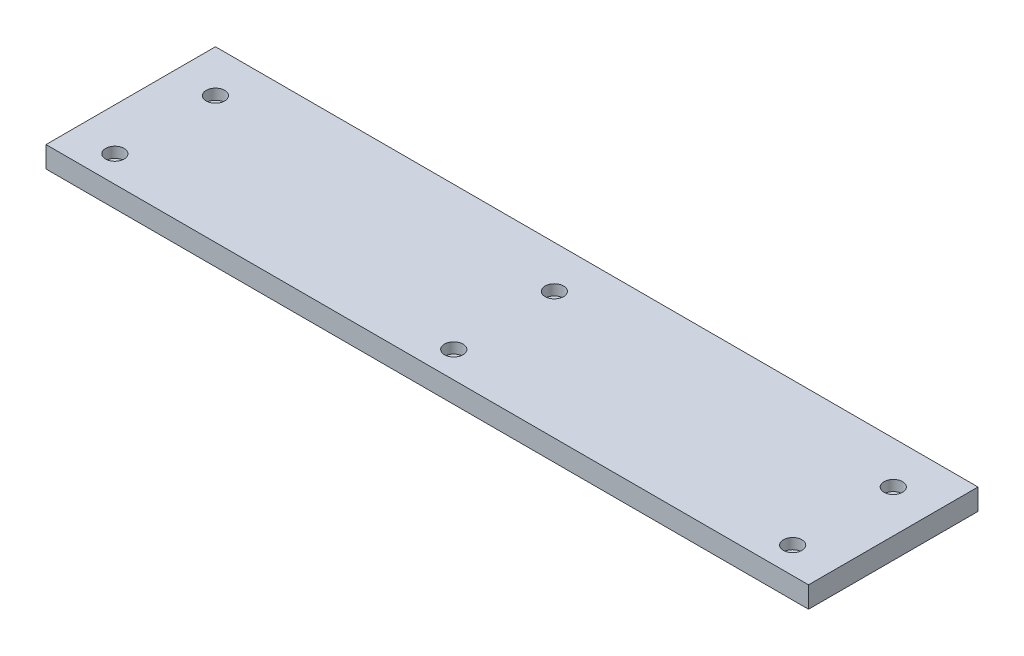
ISO-10303-21;
HEADER;
FILE_DESCRIPTION(('STEP AP214'),'2;1');
FILE_NAME('part.step','',(''),(''),'','','');
FILE_SCHEMA(('AUTOMOTIVE_DESIGN { 1 0 10303 214 1 1 1 1 }'));
ENDSEC;
DATA;
#1=APPLICATION_CONTEXT('core data for automotive mechanical design processes');
#2=APPLICATION_PROTOCOL_DEFINITION('international standard','automotive_design',2000,#1);
#3=PRODUCT_CONTEXT('',#1,'mechanical');
#4=PRODUCT('Part','Part','',(#3));
#5=PRODUCT_RELATED_PRODUCT_CATEGORY('part','',(#4));
#6=PRODUCT_DEFINITION_FORMATION('','',#4);
#7=PRODUCT_DEFINITION_CONTEXT('part definition',#1,'design');
#8=PRODUCT_DEFINITION('design','',#6,#7);
#9=PRODUCT_DEFINITION_SHAPE('','',#8);
#10=(LENGTH_UNIT() NAMED_UNIT(*) SI_UNIT(.MILLI.,.METRE.));
#11=(NAMED_UNIT(*) PLANE_ANGLE_UNIT() SI_UNIT($,.RADIAN.));
#12=(NAMED_UNIT(*) SI_UNIT($,.STERADIAN.) SOLID_ANGLE_UNIT());
#13=UNCERTAINTY_MEASURE_WITH_UNIT(LENGTH_MEASURE(1.E-05),#10,'distance_accuracy_value','');
#14=(GEOMETRIC_REPRESENTATION_CONTEXT(3) GLOBAL_UNCERTAINTY_ASSIGNED_CONTEXT((#13)) GLOBAL_UNIT_ASSIGNED_CONTEXT((#10,
#11,#12)) REPRESENTATION_CONTEXT('',''));
#15=CARTESIAN_POINT('',(0.,0.,0.));
#16=DIRECTION('',(0.,0.,1.));
#17=DIRECTION('',(1.,0.,0.));
#18=AXIS2_PLACEMENT_3D('',#15,#16,#17);
#19=CARTESIAN_POINT('',(-228.6,-12.7,-50.8));
#20=DIRECTION('',(-1.,0.,0.));
#21=DIRECTION('',(0.,0.,1.));
#22=AXIS2_PLACEMENT_3D('',#19,#20,#21);
#23=PLANE('',#22);
#24=DIRECTION('',(0.,0.,1.));
#25=VECTOR('',#24,1.);
#26=CARTESIAN_POINT('',(-228.6,0.,-50.8));
#27=LINE('',#26,#25);
#28=CARTESIAN_POINT('',(-228.6,0.,-50.8));
#29=VERTEX_POINT('',#28);
#30=CARTESIAN_POINT('',(-228.6,0.,50.8));
#31=VERTEX_POINT('',#30);
#32=EDGE_CURVE('E112',#29,#31,#27,.T.);
#33=ORIENTED_EDGE('',*,*,#32,.F.);
#34=DIRECTION('',(0.,1.,0.));
#35=VECTOR('',#34,1.);
#36=CARTESIAN_POINT('',(-228.6,-12.7,-50.8));
#37=LINE('',#36,#35);
#38=CARTESIAN_POINT('',(-228.6,-12.7,-50.8));
#39=VERTEX_POINT('',#38);
#40=EDGE_CURVE('E13',#39,#29,#37,.T.);
#41=ORIENTED_EDGE('',*,*,#40,.F.);
#42=DIRECTION('',(0.,0.,1.));
#43=VECTOR('',#42,1.);
#44=CARTESIAN_POINT('',(-228.6,-12.7,-50.8));
#45=LINE('',#44,#43);
#46=CARTESIAN_POINT('',(-228.6,-12.7,50.8));
#47=VERTEX_POINT('',#46);
#48=EDGE_CURVE('E105',#39,#47,#45,.T.);
#49=ORIENTED_EDGE('',*,*,#48,.T.);
#50=DIRECTION('',(0.,1.,0.));
#51=VECTOR('',#50,1.);
#52=CARTESIAN_POINT('',(-228.6,-12.7,50.8));
#53=LINE('',#52,#51);
#54=EDGE_CURVE('E88',#47,#31,#53,.T.);
#55=ORIENTED_EDGE('',*,*,#54,.T.);
#56=EDGE_LOOP('',(#33,#41,#49,#55));
#57=FACE_BOUND('',#56,.T.);
#58=ADVANCED_FACE('F45',(#57),#23,.T.);
#59=CARTESIAN_POINT('',(228.6,-12.7,-50.8));
#60=DIRECTION('',(0.,0.,-1.));
#61=DIRECTION('',(-1.,0.,0.));
#62=AXIS2_PLACEMENT_3D('',#59,#60,#61);
#63=PLANE('',#62);
#64=DIRECTION('',(-1.,0.,0.));
#65=VECTOR('',#64,1.);
#66=CARTESIAN_POINT('',(228.6,0.,-50.8));
#67=LINE('',#66,#65);
#68=CARTESIAN_POINT('',(228.6,0.,-50.8));
#69=VERTEX_POINT('',#68);
#70=EDGE_CURVE('E107',#69,#29,#67,.T.);
#71=ORIENTED_EDGE('',*,*,#70,.F.);
#72=DIRECTION('',(0.,1.,0.));
#73=VECTOR('',#72,1.);
#74=CARTESIAN_POINT('',(228.6,-12.7,-50.8));
#75=LINE('',#74,#73);
#76=CARTESIAN_POINT('',(228.6,-12.7,-50.8));
#77=VERTEX_POINT('',#76);
#78=EDGE_CURVE('E54',#77,#69,#75,.T.);
#79=ORIENTED_EDGE('',*,*,#78,.F.);
#80=DIRECTION('',(-1.,0.,0.));
#81=VECTOR('',#80,1.);
#82=CARTESIAN_POINT('',(228.6,-12.7,-50.8));
#83=LINE('',#82,#81);
#84=EDGE_CURVE('E102',#77,#39,#83,.T.);
#85=ORIENTED_EDGE('',*,*,#84,.T.);
#86=ORIENTED_EDGE('',*,*,#40,.T.);
#87=EDGE_LOOP('',(#71,#79,#85,#86));
#88=FACE_BOUND('',#87,.T.);
#89=ADVANCED_FACE('F204',(#88),#63,.T.);
#90=CARTESIAN_POINT('',(228.6,-12.7,-50.8));
#91=DIRECTION('',(1.,0.,0.));
#92=DIRECTION('',(0.,0.,-1.));
#93=AXIS2_PLACEMENT_3D('',#90,#91,#92);
#94=PLANE('',#93);
#95=DIRECTION('',(0.,0.,-1.));
#96=VECTOR('',#95,1.);
#97=CARTESIAN_POINT('',(228.6,0.,-50.8));
#98=LINE('',#97,#96);
#99=CARTESIAN_POINT('',(228.6,0.,50.8));
#100=VERTEX_POINT('',#99);
#101=EDGE_CURVE('E96',#100,#69,#98,.T.);
#102=ORIENTED_EDGE('',*,*,#101,.F.);
#103=DIRECTION('',(0.,1.,0.));
#104=VECTOR('',#103,1.);
#105=CARTESIAN_POINT('',(228.6,-12.7,50.8));
#106=LINE('',#105,#104);
#107=CARTESIAN_POINT('',(228.6,-12.7,50.8));
#108=VERTEX_POINT('',#107);
#109=EDGE_CURVE('E91',#108,#100,#106,.T.);
#110=ORIENTED_EDGE('',*,*,#109,.F.);
#111=DIRECTION('',(0.,0.,-1.));
#112=VECTOR('',#111,1.);
#113=CARTESIAN_POINT('',(228.6,-12.7,-50.8));
#114=LINE('',#113,#112);
#115=EDGE_CURVE('E94',#108,#77,#114,.T.);
#116=ORIENTED_EDGE('',*,*,#115,.T.);
#117=ORIENTED_EDGE('',*,*,#78,.T.);
#118=EDGE_LOOP('',(#102,#110,#116,#117));
#119=FACE_BOUND('',#118,.T.);
#120=ADVANCED_FACE('F93',(#119),#94,.T.);
#121=CARTESIAN_POINT('',(228.6,-12.7,50.8));
#122=DIRECTION('',(0.,0.,1.));
#123=DIRECTION('',(1.,0.,0.));
#124=AXIS2_PLACEMENT_3D('',#121,#122,#123);
#125=PLANE('',#124);
#126=DIRECTION('',(1.,0.,0.));
#127=VECTOR('',#126,1.);
#128=CARTESIAN_POINT('',(228.6,0.,50.8));
#129=LINE('',#128,#127);
#130=EDGE_CURVE('E115',#31,#100,#129,.T.);
#131=ORIENTED_EDGE('',*,*,#130,.F.);
#132=ORIENTED_EDGE('',*,*,#54,.F.);
#133=DIRECTION('',(1.,0.,0.));
#134=VECTOR('',#133,1.);
#135=CARTESIAN_POINT('',(228.6,-12.7,50.8));
#136=LINE('',#135,#134);
#137=EDGE_CURVE('E101',#47,#108,#136,.T.);
#138=ORIENTED_EDGE('',*,*,#137,.T.);
#139=ORIENTED_EDGE('',*,*,#109,.T.);
#140=EDGE_LOOP('',(#131,#132,#138,#139));
#141=FACE_BOUND('',#140,.T.);
#142=ADVANCED_FACE('F104',(#141),#125,.T.);
#143=CARTESIAN_POINT('',(0.,-12.7,0.));
#144=DIRECTION('',(0.,-1.,0.));
#145=DIRECTION('',(0.,0.,-1.));
#146=AXIS2_PLACEMENT_3D('',#143,#144,#145);
#147=PLANE('',#146);
#148=CARTESIAN_POINT('',(-203.2,-12.7,-25.3999999999999));
#149=DIRECTION('',(0.,-1.,0.));
#150=DIRECTION('',(0.,0.,-1.));
#151=AXIS2_PLACEMENT_3D('',#148,#149,#150);
#152=CIRCLE('',#151,3.3782);
#153=CARTESIAN_POINT('',(-203.2,-12.7,-28.7781999999999));
#154=VERTEX_POINT('',#153);
#155=EDGE_CURVE('E48',#154,#154,#152,.T.);
#156=ORIENTED_EDGE('',*,*,#155,.F.);
#157=EDGE_LOOP('',(#156));
#158=FACE_BOUND('',#157,.T.);
#159=CARTESIAN_POINT('',(-203.2,-12.7,34.925));
#160=DIRECTION('',(0.,-1.,0.));
#161=DIRECTION('',(0.,0.,-1.));
#162=AXIS2_PLACEMENT_3D('',#159,#160,#161);
#163=CIRCLE('',#162,3.3782);
#164=CARTESIAN_POINT('',(-203.2,-12.7,31.5468));
#165=VERTEX_POINT('',#164);
#166=EDGE_CURVE('E140',#165,#165,#163,.T.);
#167=ORIENTED_EDGE('',*,*,#166,.F.);
#168=EDGE_LOOP('',(#167));
#169=FACE_BOUND('',#168,.T.);
#170=CARTESIAN_POINT('',(0.,-12.7,34.925));
#171=DIRECTION('',(0.,-1.,0.));
#172=DIRECTION('',(0.,0.,-1.));
#173=AXIS2_PLACEMENT_3D('',#170,#171,#172);
#174=CIRCLE('',#173,3.3782);
#175=CARTESIAN_POINT('',(0.,-12.7,31.5468));
#176=VERTEX_POINT('',#175);
#177=EDGE_CURVE('E136',#176,#176,#174,.T.);
#178=ORIENTED_EDGE('',*,*,#177,.F.);
#179=EDGE_LOOP('',(#178));
#180=FACE_BOUND('',#179,.T.);
#181=CARTESIAN_POINT('',(0.,-12.7,-25.3999999999999));
#182=DIRECTION('',(0.,-1.,0.));
#183=DIRECTION('',(0.,0.,-1.));
#184=AXIS2_PLACEMENT_3D('',#181,#182,#183);
#185=CIRCLE('',#184,3.3782);
#186=CARTESIAN_POINT('',(0.,-12.7,-28.7781999999999));
#187=VERTEX_POINT('',#186);
#188=EDGE_CURVE('E131',#187,#187,#185,.T.);
#189=ORIENTED_EDGE('',*,*,#188,.F.);
#190=EDGE_LOOP('',(#189));
#191=FACE_BOUND('',#190,.T.);
#192=CARTESIAN_POINT('',(203.2,-12.7,-25.3999999999999));
#193=DIRECTION('',(0.,-1.,0.));
#194=DIRECTION('',(0.,0.,-1.));
#195=AXIS2_PLACEMENT_3D('',#192,#193,#194);
#196=CIRCLE('',#195,3.3782);
#197=CARTESIAN_POINT('',(203.2,-12.7,-28.7781999999999));
#198=VERTEX_POINT('',#197);
#199=EDGE_CURVE('E126',#198,#198,#196,.T.);
#200=ORIENTED_EDGE('',*,*,#199,.F.);
#201=EDGE_LOOP('',(#200));
#202=FACE_BOUND('',#201,.T.);
#203=CARTESIAN_POINT('',(203.2,-12.7,34.9249999999998));
#204=DIRECTION('',(0.,-1.,0.));
#205=DIRECTION('',(0.,0.,-1.));
#206=AXIS2_PLACEMENT_3D('',#203,#204,#205);
#207=CIRCLE('',#206,3.3782);
#208=CARTESIAN_POINT('',(203.2,-12.7,31.5467999999998));
#209=VERTEX_POINT('',#208);
#210=EDGE_CURVE('E116',#209,#209,#207,.T.);
#211=ORIENTED_EDGE('',*,*,#210,.F.);
#212=EDGE_LOOP('',(#211));
#213=FACE_BOUND('',#212,.T.);
#214=ORIENTED_EDGE('',*,*,#48,.F.);
#215=ORIENTED_EDGE('',*,*,#84,.F.);
#216=ORIENTED_EDGE('',*,*,#115,.F.);
#217=ORIENTED_EDGE('',*,*,#137,.F.);
#218=EDGE_LOOP('',(#214,#215,#216,#217));
#219=FACE_BOUND('',#218,.T.);
#220=ADVANCED_FACE('F100',(#158,#169,#180,#191,#202,#213,#219),#147,.T.);
#221=CARTESIAN_POINT('',(0.,0.,0.));
#222=DIRECTION('',(0.,-1.,0.));
#223=DIRECTION('',(0.,0.,-1.));
#224=AXIS2_PLACEMENT_3D('',#221,#222,#223);
#225=PLANE('',#224);
#226=CARTESIAN_POINT('',(-203.2,0.,-25.3999999999999));
#227=DIRECTION('',(0.,1.,0.));
#228=DIRECTION('',(0.,0.,1.));
#229=AXIS2_PLACEMENT_3D('',#226,#227,#228);
#230=CIRCLE('',#229,5.55624999999998);
#231=CARTESIAN_POINT('',(-203.2,0.,-19.8437499999999));
#232=VERTEX_POINT('',#231);
#233=EDGE_CURVE('E291',#232,#232,#230,.T.);
#234=ORIENTED_EDGE('',*,*,#233,.F.);
#235=EDGE_LOOP('',(#234));
#236=FACE_BOUND('',#235,.T.);
#237=CARTESIAN_POINT('',(-203.2,0.,34.925));
#238=DIRECTION('',(0.,1.,0.));
#239=DIRECTION('',(0.,0.,1.));
#240=AXIS2_PLACEMENT_3D('',#237,#238,#239);
#241=CIRCLE('',#240,5.55624999999998);
#242=CARTESIAN_POINT('',(-203.2,0.,40.48125));
#243=VERTEX_POINT('',#242);
#244=EDGE_CURVE('E155',#243,#243,#241,.T.);
#245=ORIENTED_EDGE('',*,*,#244,.F.);
#246=EDGE_LOOP('',(#245));
#247=FACE_BOUND('',#246,.T.);
#248=CARTESIAN_POINT('',(0.,0.,34.925));
#249=DIRECTION('',(0.,1.,0.));
#250=DIRECTION('',(0.,0.,1.));
#251=AXIS2_PLACEMENT_3D('',#248,#249,#250);
#252=CIRCLE('',#251,5.55625);
#253=CARTESIAN_POINT('',(0.,0.,40.48125));
#254=VERTEX_POINT('',#253);
#255=EDGE_CURVE('E142',#254,#254,#252,.T.);
#256=ORIENTED_EDGE('',*,*,#255,.F.);
#257=EDGE_LOOP('',(#256));
#258=FACE_BOUND('',#257,.T.);
#259=CARTESIAN_POINT('',(0.,0.,-25.3999999999999));
#260=DIRECTION('',(0.,1.,0.));
#261=DIRECTION('',(0.,0.,1.));
#262=AXIS2_PLACEMENT_3D('',#259,#260,#261);
#263=CIRCLE('',#262,5.55625);
#264=CARTESIAN_POINT('',(0.,0.,-19.8437499999999));
#265=VERTEX_POINT('',#264);
#266=EDGE_CURVE('E138',#265,#265,#263,.T.);
#267=ORIENTED_EDGE('',*,*,#266,.F.);
#268=EDGE_LOOP('',(#267));
#269=FACE_BOUND('',#268,.T.);
#270=CARTESIAN_POINT('',(203.2,0.,-25.3999999999999));
#271=DIRECTION('',(0.,1.,0.));
#272=DIRECTION('',(0.,0.,1.));
#273=AXIS2_PLACEMENT_3D('',#270,#271,#272);
#274=CIRCLE('',#273,5.55624999999998);
#275=CARTESIAN_POINT('',(203.2,0.,-19.84375));
#276=VERTEX_POINT('',#275);
#277=EDGE_CURVE('E134',#276,#276,#274,.T.);
#278=ORIENTED_EDGE('',*,*,#277,.F.);
#279=EDGE_LOOP('',(#278));
#280=FACE_BOUND('',#279,.T.);
#281=CARTESIAN_POINT('',(203.2,0.,34.9249999999998));
#282=DIRECTION('',(0.,1.,0.));
#283=DIRECTION('',(0.,0.,1.));
#284=AXIS2_PLACEMENT_3D('',#281,#282,#283);
#285=CIRCLE('',#284,5.55624999999998);
#286=CARTESIAN_POINT('',(203.2,0.,40.4812499999998));
#287=VERTEX_POINT('',#286);
#288=EDGE_CURVE('E129',#287,#287,#285,.T.);
#289=ORIENTED_EDGE('',*,*,#288,.F.);
#290=EDGE_LOOP('',(#289));
#291=FACE_BOUND('',#290,.T.);
#292=ORIENTED_EDGE('',*,*,#32,.T.);
#293=ORIENTED_EDGE('',*,*,#130,.T.);
#294=ORIENTED_EDGE('',*,*,#101,.T.);
#295=ORIENTED_EDGE('',*,*,#70,.T.);
#296=EDGE_LOOP('',(#292,#293,#294,#295));
#297=FACE_BOUND('',#296,.T.);
#298=ADVANCED_FACE('F199',(#236,#247,#258,#269,#280,#291,#297),#225,.F.);
#299=CARTESIAN_POINT('',(203.2,0.,34.9249999999998));
#300=DIRECTION('',(0.,1.,0.));
#301=DIRECTION('',(0.,0.,1.));
#302=AXIS2_PLACEMENT_3D('',#299,#300,#301);
#303=CYLINDRICAL_SURFACE('',#302,3.3782);
#304=ORIENTED_EDGE('',*,*,#210,.T.);
#305=EDGE_LOOP('',(#304));
#306=FACE_BOUND('',#305,.T.);
#307=CARTESIAN_POINT('',(203.2,-6.35,34.9249999999998));
#308=DIRECTION('',(0.,1.,0.));
#309=DIRECTION('',(0.,0.,1.));
#310=AXIS2_PLACEMENT_3D('',#307,#308,#309);
#311=CIRCLE('',#310,3.3782);
#312=CARTESIAN_POINT('',(203.2,-6.35,38.3031999999998));
#313=VERTEX_POINT('',#312);
#314=EDGE_CURVE('E125',#313,#313,#311,.T.);
#315=ORIENTED_EDGE('',*,*,#314,.T.);
#316=EDGE_LOOP('',(#315));
#317=FACE_BOUND('',#316,.T.);
#318=ADVANCED_FACE('F184',(#306,#317),#303,.F.);
#319=CARTESIAN_POINT('',(206.5782,-6.35,34.9249999999998));
#320=DIRECTION('',(0.,-1.,0.));
#321=DIRECTION('',(0.,0.,-1.));
#322=AXIS2_PLACEMENT_3D('',#319,#320,#321);
#323=PLANE('',#322);
#324=ORIENTED_EDGE('',*,*,#314,.F.);
#325=EDGE_LOOP('',(#324));
#326=FACE_BOUND('',#325,.T.);
#327=CARTESIAN_POINT('',(203.2,-6.35,34.9249999999998));
#328=DIRECTION('',(0.,1.,0.));
#329=DIRECTION('',(0.,0.,1.));
#330=AXIS2_PLACEMENT_3D('',#327,#328,#329);
#331=CIRCLE('',#330,5.55624999999998);
#332=CARTESIAN_POINT('',(203.2,-6.35,40.4812499999998));
#333=VERTEX_POINT('',#332);
#334=EDGE_CURVE('E179',#333,#333,#331,.T.);
#335=ORIENTED_EDGE('',*,*,#334,.T.);
#336=EDGE_LOOP('',(#335));
#337=FACE_BOUND('',#336,.T.);
#338=ADVANCED_FACE('F186',(#326,#337),#323,.F.);
#339=CARTESIAN_POINT('',(203.2,0.,34.9249999999998));
#340=DIRECTION('',(0.,1.,0.));
#341=DIRECTION('',(0.,0.,1.));
#342=AXIS2_PLACEMENT_3D('',#339,#340,#341);
#343=CYLINDRICAL_SURFACE('',#342,5.55624999999998);
#344=ORIENTED_EDGE('',*,*,#334,.F.);
#345=EDGE_LOOP('',(#344));
#346=FACE_BOUND('',#345,.T.);
#347=ORIENTED_EDGE('',*,*,#288,.T.);
#348=EDGE_LOOP('',(#347));
#349=FACE_BOUND('',#348,.T.);
#350=ADVANCED_FACE('F189',(#346,#349),#343,.F.);
#351=CARTESIAN_POINT('',(203.2,0.,-25.3999999999999));
#352=DIRECTION('',(0.,1.,0.));
#353=DIRECTION('',(0.,0.,1.));
#354=AXIS2_PLACEMENT_3D('',#351,#352,#353);
#355=CYLINDRICAL_SURFACE('',#354,3.3782);
#356=ORIENTED_EDGE('',*,*,#199,.T.);
#357=EDGE_LOOP('',(#356));
#358=FACE_BOUND('',#357,.T.);
#359=CARTESIAN_POINT('',(203.2,-6.35,-25.3999999999999));
#360=DIRECTION('',(0.,1.,0.));
#361=DIRECTION('',(0.,0.,1.));
#362=AXIS2_PLACEMENT_3D('',#359,#360,#361);
#363=CIRCLE('',#362,3.3782);
#364=CARTESIAN_POINT('',(203.2,-6.35,-22.0217999999999));
#365=VERTEX_POINT('',#364);
#366=EDGE_CURVE('E130',#365,#365,#363,.T.);
#367=ORIENTED_EDGE('',*,*,#366,.T.);
#368=EDGE_LOOP('',(#367));
#369=FACE_BOUND('',#368,.T.);
#370=ADVANCED_FACE('F195',(#358,#369),#355,.F.);
#371=CARTESIAN_POINT('',(206.5782,-6.35,-25.3999999999999));
#372=DIRECTION('',(0.,-1.,0.));
#373=DIRECTION('',(0.,0.,-1.));
#374=AXIS2_PLACEMENT_3D('',#371,#372,#373);
#375=PLANE('',#374);
#376=ORIENTED_EDGE('',*,*,#366,.F.);
#377=EDGE_LOOP('',(#376));
#378=FACE_BOUND('',#377,.T.);
#379=CARTESIAN_POINT('',(203.2,-6.35,-25.3999999999999));
#380=DIRECTION('',(0.,1.,0.));
#381=DIRECTION('',(0.,0.,1.));
#382=AXIS2_PLACEMENT_3D('',#379,#380,#381);
#383=CIRCLE('',#382,5.55624999999998);
#384=CARTESIAN_POINT('',(203.2,-6.35,-19.84375));
#385=VERTEX_POINT('',#384);
#386=EDGE_CURVE('E172',#385,#385,#383,.T.);
#387=ORIENTED_EDGE('',*,*,#386,.T.);
#388=EDGE_LOOP('',(#387));
#389=FACE_BOUND('',#388,.T.);
#390=ADVANCED_FACE('F228',(#378,#389),#375,.F.);
#391=CARTESIAN_POINT('',(203.2,0.,-25.3999999999999));
#392=DIRECTION('',(0.,1.,0.));
#393=DIRECTION('',(0.,0.,1.));
#394=AXIS2_PLACEMENT_3D('',#391,#392,#393);
#395=CYLINDRICAL_SURFACE('',#394,5.55624999999998);
#396=ORIENTED_EDGE('',*,*,#386,.F.);
#397=EDGE_LOOP('',(#396));
#398=FACE_BOUND('',#397,.T.);
#399=ORIENTED_EDGE('',*,*,#277,.T.);
#400=EDGE_LOOP('',(#399));
#401=FACE_BOUND('',#400,.T.);
#402=ADVANCED_FACE('F232',(#398,#401),#395,.F.);
#403=CARTESIAN_POINT('',(0.,0.,-25.3999999999999));
#404=DIRECTION('',(0.,1.,0.));
#405=DIRECTION('',(0.,0.,1.));
#406=AXIS2_PLACEMENT_3D('',#403,#404,#405);
#407=CYLINDRICAL_SURFACE('',#406,3.3782);
#408=ORIENTED_EDGE('',*,*,#188,.T.);
#409=EDGE_LOOP('',(#408));
#410=FACE_BOUND('',#409,.T.);
#411=CARTESIAN_POINT('',(0.,-6.35,-25.3999999999999));
#412=DIRECTION('',(0.,1.,0.));
#413=DIRECTION('',(0.,0.,1.));
#414=AXIS2_PLACEMENT_3D('',#411,#412,#413);
#415=CIRCLE('',#414,3.3782);
#416=CARTESIAN_POINT('',(0.,-6.35,-22.0217999999999));
#417=VERTEX_POINT('',#416);
#418=EDGE_CURVE('E135',#417,#417,#415,.T.);
#419=ORIENTED_EDGE('',*,*,#418,.T.);
#420=EDGE_LOOP('',(#419));
#421=FACE_BOUND('',#420,.T.);
#422=ADVANCED_FACE('F236',(#410,#421),#407,.F.);
#423=CARTESIAN_POINT('',(3.3782,-6.35,-25.3999999999999));
#424=DIRECTION('',(0.,-1.,0.));
#425=DIRECTION('',(0.,0.,-1.));
#426=AXIS2_PLACEMENT_3D('',#423,#424,#425);
#427=PLANE('',#426);
#428=ORIENTED_EDGE('',*,*,#418,.F.);
#429=EDGE_LOOP('',(#428));
#430=FACE_BOUND('',#429,.T.);
#431=CARTESIAN_POINT('',(0.,-6.35,-25.3999999999999));
#432=DIRECTION('',(0.,1.,0.));
#433=DIRECTION('',(0.,0.,1.));
#434=AXIS2_PLACEMENT_3D('',#431,#432,#433);
#435=CIRCLE('',#434,5.55625);
#436=CARTESIAN_POINT('',(0.,-6.35,-19.8437499999999));
#437=VERTEX_POINT('',#436);
#438=EDGE_CURVE('E165',#437,#437,#435,.T.);
#439=ORIENTED_EDGE('',*,*,#438,.T.);
#440=EDGE_LOOP('',(#439));
#441=FACE_BOUND('',#440,.T.);
#442=ADVANCED_FACE('F240',(#430,#441),#427,.F.);
#443=CARTESIAN_POINT('',(0.,0.,-25.3999999999999));
#444=DIRECTION('',(0.,1.,0.));
#445=DIRECTION('',(0.,0.,1.));
#446=AXIS2_PLACEMENT_3D('',#443,#444,#445);
#447=CYLINDRICAL_SURFACE('',#446,5.55625);
#448=ORIENTED_EDGE('',*,*,#438,.F.);
#449=EDGE_LOOP('',(#448));
#450=FACE_BOUND('',#449,.T.);
#451=ORIENTED_EDGE('',*,*,#266,.T.);
#452=EDGE_LOOP('',(#451));
#453=FACE_BOUND('',#452,.T.);
#454=ADVANCED_FACE('F244',(#450,#453),#447,.F.);
#455=CARTESIAN_POINT('',(0.,0.,34.925));
#456=DIRECTION('',(0.,1.,0.));
#457=DIRECTION('',(0.,0.,1.));
#458=AXIS2_PLACEMENT_3D('',#455,#456,#457);
#459=CYLINDRICAL_SURFACE('',#458,3.3782);
#460=ORIENTED_EDGE('',*,*,#177,.T.);
#461=EDGE_LOOP('',(#460));
#462=FACE_BOUND('',#461,.T.);
#463=CARTESIAN_POINT('',(0.,-6.35,34.925));
#464=DIRECTION('',(0.,1.,0.));
#465=DIRECTION('',(0.,0.,1.));
#466=AXIS2_PLACEMENT_3D('',#463,#464,#465);
#467=CIRCLE('',#466,3.3782);
#468=CARTESIAN_POINT('',(0.,-6.35,38.3032));
#469=VERTEX_POINT('',#468);
#470=EDGE_CURVE('E139',#469,#469,#467,.T.);
#471=ORIENTED_EDGE('',*,*,#470,.T.);
#472=EDGE_LOOP('',(#471));
#473=FACE_BOUND('',#472,.T.);
#474=ADVANCED_FACE('F248',(#462,#473),#459,.F.);
#475=CARTESIAN_POINT('',(3.3782,-6.35,34.925));
#476=DIRECTION('',(0.,-1.,0.));
#477=DIRECTION('',(0.,0.,-1.));
#478=AXIS2_PLACEMENT_3D('',#475,#476,#477);
#479=PLANE('',#478);
#480=ORIENTED_EDGE('',*,*,#470,.F.);
#481=EDGE_LOOP('',(#480));
#482=FACE_BOUND('',#481,.T.);
#483=CARTESIAN_POINT('',(0.,-6.35,34.925));
#484=DIRECTION('',(0.,1.,0.));
#485=DIRECTION('',(0.,0.,1.));
#486=AXIS2_PLACEMENT_3D('',#483,#484,#485);
#487=CIRCLE('',#486,5.55625);
#488=CARTESIAN_POINT('',(0.,-6.35,40.48125));
#489=VERTEX_POINT('',#488);
#490=EDGE_CURVE('E147',#489,#489,#487,.T.);
#491=ORIENTED_EDGE('',*,*,#490,.T.);
#492=EDGE_LOOP('',(#491));
#493=FACE_BOUND('',#492,.T.);
#494=ADVANCED_FACE('F252',(#482,#493),#479,.F.);
#495=CARTESIAN_POINT('',(0.,0.,34.925));
#496=DIRECTION('',(0.,1.,0.));
#497=DIRECTION('',(0.,0.,1.));
#498=AXIS2_PLACEMENT_3D('',#495,#496,#497);
#499=CYLINDRICAL_SURFACE('',#498,5.55625);
#500=ORIENTED_EDGE('',*,*,#490,.F.);
#501=EDGE_LOOP('',(#500));
#502=FACE_BOUND('',#501,.T.);
#503=ORIENTED_EDGE('',*,*,#255,.T.);
#504=EDGE_LOOP('',(#503));
#505=FACE_BOUND('',#504,.T.);
#506=ADVANCED_FACE('F256',(#502,#505),#499,.F.);
#507=CARTESIAN_POINT('',(-203.2,0.,34.925));
#508=DIRECTION('',(0.,1.,0.));
#509=DIRECTION('',(0.,0.,1.));
#510=AXIS2_PLACEMENT_3D('',#507,#508,#509);
#511=CYLINDRICAL_SURFACE('',#510,3.3782);
#512=ORIENTED_EDGE('',*,*,#166,.T.);
#513=EDGE_LOOP('',(#512));
#514=FACE_BOUND('',#513,.T.);
#515=CARTESIAN_POINT('',(-203.2,-6.35,34.925));
#516=DIRECTION('',(0.,1.,0.));
#517=DIRECTION('',(0.,0.,1.));
#518=AXIS2_PLACEMENT_3D('',#515,#516,#517);
#519=CIRCLE('',#518,3.3782);
#520=CARTESIAN_POINT('',(-203.2,-6.35,38.3032));
#521=VERTEX_POINT('',#520);
#522=EDGE_CURVE('E143',#521,#521,#519,.T.);
#523=ORIENTED_EDGE('',*,*,#522,.T.);
#524=EDGE_LOOP('',(#523));
#525=FACE_BOUND('',#524,.T.);
#526=ADVANCED_FACE('F260',(#514,#525),#511,.F.);
#527=CARTESIAN_POINT('',(-199.8218,-6.35,34.925));
#528=DIRECTION('',(0.,-1.,0.));
#529=DIRECTION('',(0.,0.,-1.));
#530=AXIS2_PLACEMENT_3D('',#527,#528,#529);
#531=PLANE('',#530);
#532=ORIENTED_EDGE('',*,*,#522,.F.);
#533=EDGE_LOOP('',(#532));
#534=FACE_BOUND('',#533,.T.);
#535=CARTESIAN_POINT('',(-203.2,-6.35,34.925));
#536=DIRECTION('',(0.,1.,0.));
#537=DIRECTION('',(0.,0.,1.));
#538=AXIS2_PLACEMENT_3D('',#535,#536,#537);
#539=CIRCLE('',#538,5.55624999999998);
#540=CARTESIAN_POINT('',(-203.2,-6.35,40.48125));
#541=VERTEX_POINT('',#540);
#542=EDGE_CURVE('E150',#541,#541,#539,.T.);
#543=ORIENTED_EDGE('',*,*,#542,.T.);
#544=EDGE_LOOP('',(#543));
#545=FACE_BOUND('',#544,.T.);
#546=ADVANCED_FACE('F264',(#534,#545),#531,.F.);
#547=CARTESIAN_POINT('',(-203.2,0.,34.925));
#548=DIRECTION('',(0.,1.,0.));
#549=DIRECTION('',(0.,0.,1.));
#550=AXIS2_PLACEMENT_3D('',#547,#548,#549);
#551=CYLINDRICAL_SURFACE('',#550,5.55624999999998);
#552=ORIENTED_EDGE('',*,*,#542,.F.);
#553=EDGE_LOOP('',(#552));
#554=FACE_BOUND('',#553,.T.);
#555=ORIENTED_EDGE('',*,*,#244,.T.);
#556=EDGE_LOOP('',(#555));
#557=FACE_BOUND('',#556,.T.);
#558=ADVANCED_FACE('F267',(#554,#557),#551,.F.);
#559=CARTESIAN_POINT('',(-203.2,0.,-25.3999999999999));
#560=DIRECTION('',(0.,1.,0.));
#561=DIRECTION('',(0.,0.,1.));
#562=AXIS2_PLACEMENT_3D('',#559,#560,#561);
#563=CYLINDRICAL_SURFACE('',#562,3.3782);
#564=ORIENTED_EDGE('',*,*,#155,.T.);
#565=EDGE_LOOP('',(#564));
#566=FACE_BOUND('',#565,.T.);
#567=CARTESIAN_POINT('',(-203.2,-6.35,-25.3999999999999));
#568=DIRECTION('',(0.,1.,0.));
#569=DIRECTION('',(0.,0.,1.));
#570=AXIS2_PLACEMENT_3D('',#567,#568,#569);
#571=CIRCLE('',#570,3.3782);
#572=CARTESIAN_POINT('',(-203.2,-6.35,-22.0217999999999));
#573=VERTEX_POINT('',#572);
#574=EDGE_CURVE('E293',#573,#573,#571,.T.);
#575=ORIENTED_EDGE('',*,*,#574,.T.);
#576=EDGE_LOOP('',(#575));
#577=FACE_BOUND('',#576,.T.);
#578=ADVANCED_FACE('F271',(#566,#577),#563,.F.);
#579=CARTESIAN_POINT('',(-199.8218,-6.35,-25.3999999999999));
#580=DIRECTION('',(0.,-1.,0.));
#581=DIRECTION('',(0.,0.,-1.));
#582=AXIS2_PLACEMENT_3D('',#579,#580,#581);
#583=PLANE('',#582);
#584=ORIENTED_EDGE('',*,*,#574,.F.);
#585=EDGE_LOOP('',(#584));
#586=FACE_BOUND('',#585,.T.);
#587=CARTESIAN_POINT('',(-203.2,-6.35,-25.3999999999999));
#588=DIRECTION('',(0.,1.,0.));
#589=DIRECTION('',(0.,0.,1.));
#590=AXIS2_PLACEMENT_3D('',#587,#588,#589);
#591=CIRCLE('',#590,5.55624999999998);
#592=CARTESIAN_POINT('',(-203.2,-6.35,-19.8437499999999));
#593=VERTEX_POINT('',#592);
#594=EDGE_CURVE('E288',#593,#593,#591,.T.);
#595=ORIENTED_EDGE('',*,*,#594,.T.);
#596=EDGE_LOOP('',(#595));
#597=FACE_BOUND('',#596,.T.);
#598=ADVANCED_FACE('F275',(#586,#597),#583,.F.);
#599=CARTESIAN_POINT('',(-203.2,0.,-25.3999999999999));
#600=DIRECTION('',(0.,1.,0.));
#601=DIRECTION('',(0.,0.,1.));
#602=AXIS2_PLACEMENT_3D('',#599,#600,#601);
#603=CYLINDRICAL_SURFACE('',#602,5.55624999999998);
#604=ORIENTED_EDGE('',*,*,#594,.F.);
#605=EDGE_LOOP('',(#604));
#606=FACE_BOUND('',#605,.T.);
#607=ORIENTED_EDGE('',*,*,#233,.T.);
#608=EDGE_LOOP('',(#607));
#609=FACE_BOUND('',#608,.T.);
#610=ADVANCED_FACE('F279',(#606,#609),#603,.F.);
#611=CLOSED_SHELL('',(#58,#89,#120,#142,#220,#298,#318,#338,#350,#370,#390,#402,#422,#442,#454,
#474,#494,#506,#526,#546,#558,#578,#598,#610));
#612=MANIFOLD_SOLID_BREP('B2',#611);
#613=ADVANCED_BREP_SHAPE_REPRESENTATION('',(#18,#612),#14);
#614=SHAPE_DEFINITION_REPRESENTATION(#9,#613);
ENDSEC;
END-ISO-10303-21;
